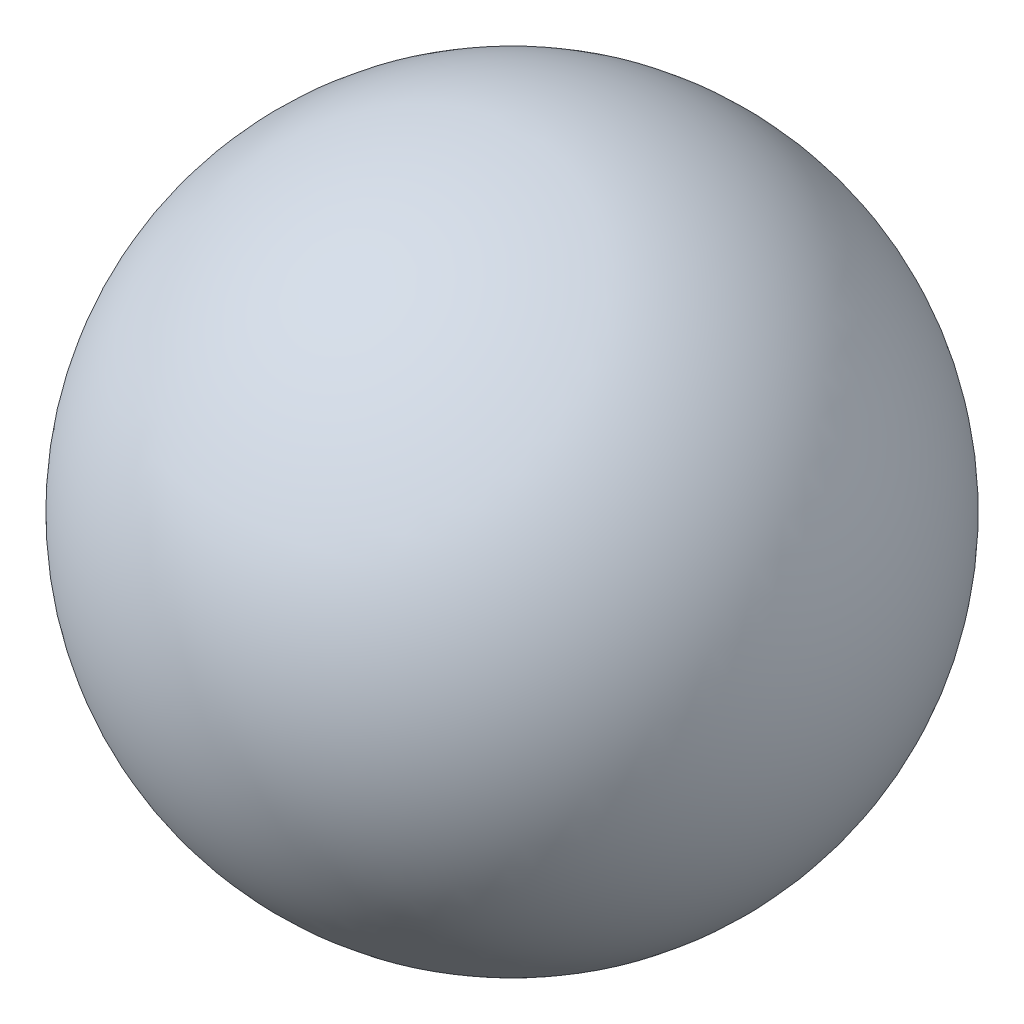
ISO-10303-21;
HEADER;
FILE_DESCRIPTION(('STEP AP214'),'2;1');
FILE_NAME('part.step','',(''),(''),'','','');
FILE_SCHEMA(('AUTOMOTIVE_DESIGN { 1 0 10303 214 1 1 1 1 }'));
ENDSEC;
DATA;
#1=APPLICATION_CONTEXT('core data for automotive mechanical design processes');
#2=APPLICATION_PROTOCOL_DEFINITION('international standard','automotive_design',2000,#1);
#3=PRODUCT_CONTEXT('',#1,'mechanical');
#4=PRODUCT('Part','Part','',(#3));
#5=PRODUCT_RELATED_PRODUCT_CATEGORY('part','',(#4));
#6=PRODUCT_DEFINITION_FORMATION('','',#4);
#7=PRODUCT_DEFINITION_CONTEXT('part definition',#1,'design');
#8=PRODUCT_DEFINITION('design','',#6,#7);
#9=PRODUCT_DEFINITION_SHAPE('','',#8);
#10=(LENGTH_UNIT() NAMED_UNIT(*) SI_UNIT(.MILLI.,.METRE.));
#11=(NAMED_UNIT(*) PLANE_ANGLE_UNIT() SI_UNIT($,.RADIAN.));
#12=(NAMED_UNIT(*) SI_UNIT($,.STERADIAN.) SOLID_ANGLE_UNIT());
#13=UNCERTAINTY_MEASURE_WITH_UNIT(LENGTH_MEASURE(1.E-05),#10,'distance_accuracy_value','');
#14=(GEOMETRIC_REPRESENTATION_CONTEXT(3) GLOBAL_UNCERTAINTY_ASSIGNED_CONTEXT((#13)) GLOBAL_UNIT_ASSIGNED_CONTEXT((#10,
#11,#12)) REPRESENTATION_CONTEXT('',''));
#15=CARTESIAN_POINT('',(0.,0.,0.));
#16=DIRECTION('',(0.,0.,1.));
#17=DIRECTION('',(1.,0.,0.));
#18=AXIS2_PLACEMENT_3D('',#15,#16,#17);
#19=CARTESIAN_POINT('',(0.,0.,0.));
#20=DIRECTION('',(0.,1.,0.));
#21=DIRECTION('',(1.,0.,0.));
#22=AXIS2_PLACEMENT_3D('',#19,#20,#21);
#23=SPHERICAL_SURFACE('',#22,100.);
#24=CARTESIAN_POINT('',(0.,100.,0.));
#25=VERTEX_POINT('',#24);
#26=VERTEX_LOOP('',#25);
#27=FACE_BOUND('',#26,.T.);
#28=ADVANCED_FACE('F29',(#27),#23,.T.);
#29=CLOSED_SHELL('',(#28));
#30=MANIFOLD_SOLID_BREP('B2',#29);
#31=ADVANCED_BREP_SHAPE_REPRESENTATION('',(#18,#30),#14);
#32=SHAPE_DEFINITION_REPRESENTATION(#9,#31);
ENDSEC;
END-ISO-10303-21;
